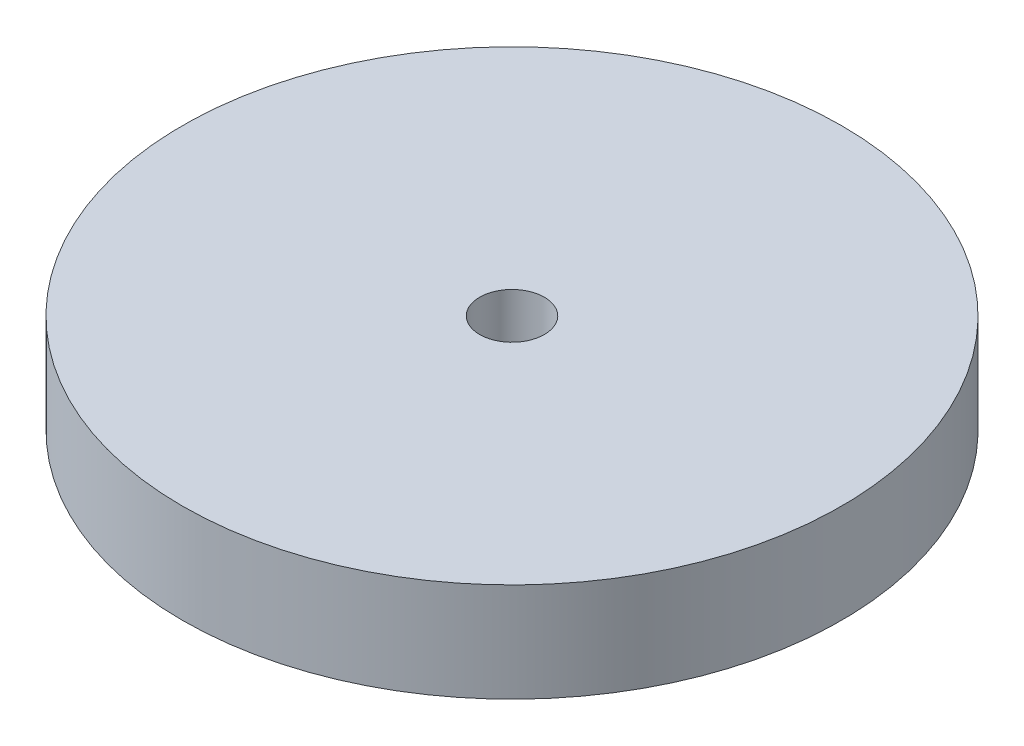
ISO-10303-21;
HEADER;
FILE_DESCRIPTION(('STEP AP214'),'2;1');
FILE_NAME('part.step','',(''),(''),'','','');
FILE_SCHEMA(('AUTOMOTIVE_DESIGN { 1 0 10303 214 1 1 1 1 }'));
ENDSEC;
DATA;
#1=APPLICATION_CONTEXT('core data for automotive mechanical design processes');
#2=APPLICATION_PROTOCOL_DEFINITION('international standard','automotive_design',2000,#1);
#3=PRODUCT_CONTEXT('',#1,'mechanical');
#4=PRODUCT('Part','Part','',(#3));
#5=PRODUCT_RELATED_PRODUCT_CATEGORY('part','',(#4));
#6=PRODUCT_DEFINITION_FORMATION('','',#4);
#7=PRODUCT_DEFINITION_CONTEXT('part definition',#1,'design');
#8=PRODUCT_DEFINITION('design','',#6,#7);
#9=PRODUCT_DEFINITION_SHAPE('','',#8);
#10=(LENGTH_UNIT() NAMED_UNIT(*) SI_UNIT(.MILLI.,.METRE.));
#11=(NAMED_UNIT(*) PLANE_ANGLE_UNIT() SI_UNIT($,.RADIAN.));
#12=(NAMED_UNIT(*) SI_UNIT($,.STERADIAN.) SOLID_ANGLE_UNIT());
#13=UNCERTAINTY_MEASURE_WITH_UNIT(LENGTH_MEASURE(1.E-05),#10,'distance_accuracy_value','');
#14=(GEOMETRIC_REPRESENTATION_CONTEXT(3) GLOBAL_UNCERTAINTY_ASSIGNED_CONTEXT((#13)) GLOBAL_UNIT_ASSIGNED_CONTEXT((#10,
#11,#12)) REPRESENTATION_CONTEXT('',''));
#15=CARTESIAN_POINT('',(0.,0.,0.));
#16=DIRECTION('',(0.,0.,1.));
#17=DIRECTION('',(1.,0.,0.));
#18=AXIS2_PLACEMENT_3D('',#15,#16,#17);
#19=CARTESIAN_POINT('',(0.,7.62,0.));
#20=DIRECTION('',(0.,-1.,0.));
#21=DIRECTION('',(0.,0.,-1.));
#22=AXIS2_PLACEMENT_3D('',#19,#20,#21);
#23=CYLINDRICAL_SURFACE('',#22,25.3731402128809);
#24=CARTESIAN_POINT('',(0.,7.62,0.));
#25=DIRECTION('',(0.,1.,0.));
#26=DIRECTION('',(0.,0.,1.));
#27=AXIS2_PLACEMENT_3D('',#24,#25,#26);
#28=CIRCLE('',#27,25.3731402128809);
#29=CARTESIAN_POINT('',(0.,7.62,25.3731402128809));
#30=VERTEX_POINT('',#29);
#31=EDGE_CURVE('E10',#30,#30,#28,.T.);
#32=ORIENTED_EDGE('',*,*,#31,.F.);
#33=EDGE_LOOP('',(#32));
#34=FACE_BOUND('',#33,.T.);
#35=CARTESIAN_POINT('',(0.,0.,0.));
#36=DIRECTION('',(0.,1.,0.));
#37=DIRECTION('',(0.,0.,1.));
#38=AXIS2_PLACEMENT_3D('',#35,#36,#37);
#39=CIRCLE('',#38,25.3731402128809);
#40=CARTESIAN_POINT('',(0.,0.,25.3731402128809));
#41=VERTEX_POINT('',#40);
#42=EDGE_CURVE('E37',#41,#41,#39,.T.);
#43=ORIENTED_EDGE('',*,*,#42,.T.);
#44=EDGE_LOOP('',(#43));
#45=FACE_BOUND('',#44,.T.);
#46=ADVANCED_FACE('F34',(#34,#45),#23,.T.);
#47=CARTESIAN_POINT('',(0.,7.62,0.));
#48=DIRECTION('',(0.,1.,0.));
#49=DIRECTION('',(0.,0.,1.));
#50=AXIS2_PLACEMENT_3D('',#47,#48,#49);
#51=PLANE('',#50);
#52=CARTESIAN_POINT('',(0.,7.62,0.));
#53=DIRECTION('',(0.,1.,0.));
#54=DIRECTION('',(0.,0.,1.));
#55=AXIS2_PLACEMENT_3D('',#52,#53,#54);
#56=CIRCLE('',#55,2.49228962626934);
#57=CARTESIAN_POINT('',(0.,7.62,2.49228962626934));
#58=VERTEX_POINT('',#57);
#59=EDGE_CURVE('E46',#58,#58,#56,.T.);
#60=ORIENTED_EDGE('',*,*,#59,.F.);
#61=EDGE_LOOP('',(#60));
#62=FACE_BOUND('',#61,.T.);
#63=ORIENTED_EDGE('',*,*,#31,.T.);
#64=EDGE_LOOP('',(#63));
#65=FACE_BOUND('',#64,.T.);
#66=ADVANCED_FACE('F61',(#62,#65),#51,.T.);
#67=CARTESIAN_POINT('',(0.,0.,0.));
#68=DIRECTION('',(0.,1.,0.));
#69=DIRECTION('',(0.,0.,1.));
#70=AXIS2_PLACEMENT_3D('',#67,#68,#69);
#71=PLANE('',#70);
#72=CARTESIAN_POINT('',(0.,0.,0.));
#73=DIRECTION('',(0.,1.,0.));
#74=DIRECTION('',(0.,0.,1.));
#75=AXIS2_PLACEMENT_3D('',#72,#73,#74);
#76=CIRCLE('',#75,2.49228962626934);
#77=CARTESIAN_POINT('',(0.,0.,2.49228962626934));
#78=VERTEX_POINT('',#77);
#79=EDGE_CURVE('E44',#78,#78,#76,.T.);
#80=ORIENTED_EDGE('',*,*,#79,.T.);
#81=EDGE_LOOP('',(#80));
#82=FACE_BOUND('',#81,.T.);
#83=ORIENTED_EDGE('',*,*,#42,.F.);
#84=EDGE_LOOP('',(#83));
#85=FACE_BOUND('',#84,.T.);
#86=ADVANCED_FACE('F52',(#82,#85),#71,.F.);
#87=CARTESIAN_POINT('',(0.,0.,0.));
#88=DIRECTION('',(0.,1.,0.));
#89=DIRECTION('',(0.,0.,1.));
#90=AXIS2_PLACEMENT_3D('',#87,#88,#89);
#91=CYLINDRICAL_SURFACE('',#90,2.49228962626934);
#92=ORIENTED_EDGE('',*,*,#79,.F.);
#93=EDGE_LOOP('',(#92));
#94=FACE_BOUND('',#93,.T.);
#95=ORIENTED_EDGE('',*,*,#59,.T.);
#96=EDGE_LOOP('',(#95));
#97=FACE_BOUND('',#96,.T.);
#98=ADVANCED_FACE('F55',(#94,#97),#91,.F.);
#99=CLOSED_SHELL('',(#46,#66,#86,#98));
#100=MANIFOLD_SOLID_BREP('B2',#99);
#101=ADVANCED_BREP_SHAPE_REPRESENTATION('',(#18,#100),#14);
#102=SHAPE_DEFINITION_REPRESENTATION(#9,#101);
ENDSEC;
END-ISO-10303-21;
